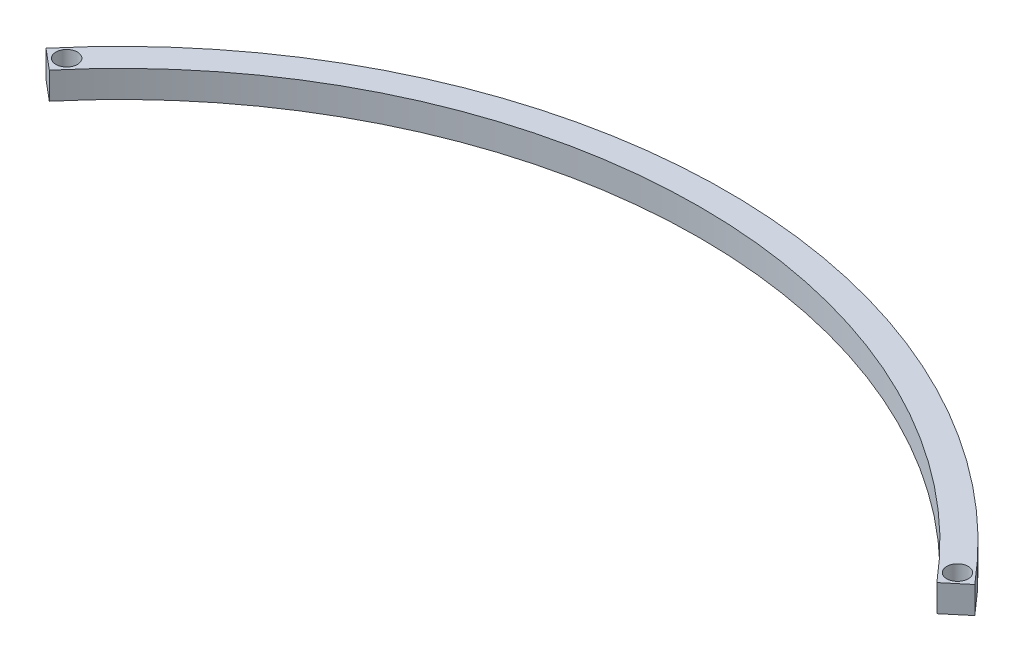
ISO-10303-21;
HEADER;
FILE_DESCRIPTION(('STEP AP214'),'2;1');
FILE_NAME('part.step','',(''),(''),'','','');
FILE_SCHEMA(('AUTOMOTIVE_DESIGN { 1 0 10303 214 1 1 1 1 }'));
ENDSEC;
DATA;
#1=APPLICATION_CONTEXT('core data for automotive mechanical design processes');
#2=APPLICATION_PROTOCOL_DEFINITION('international standard','automotive_design',2000,#1);
#3=PRODUCT_CONTEXT('',#1,'mechanical');
#4=PRODUCT('Part','Part','',(#3));
#5=PRODUCT_RELATED_PRODUCT_CATEGORY('part','',(#4));
#6=PRODUCT_DEFINITION_FORMATION('','',#4);
#7=PRODUCT_DEFINITION_CONTEXT('part definition',#1,'design');
#8=PRODUCT_DEFINITION('design','',#6,#7);
#9=PRODUCT_DEFINITION_SHAPE('','',#8);
#10=(LENGTH_UNIT() NAMED_UNIT(*) SI_UNIT(.MILLI.,.METRE.));
#11=(NAMED_UNIT(*) PLANE_ANGLE_UNIT() SI_UNIT($,.RADIAN.));
#12=(NAMED_UNIT(*) SI_UNIT($,.STERADIAN.) SOLID_ANGLE_UNIT());
#13=UNCERTAINTY_MEASURE_WITH_UNIT(LENGTH_MEASURE(1.E-05),#10,'distance_accuracy_value','');
#14=(GEOMETRIC_REPRESENTATION_CONTEXT(3) GLOBAL_UNCERTAINTY_ASSIGNED_CONTEXT((#13)) GLOBAL_UNIT_ASSIGNED_CONTEXT((#10,
#11,#12)) REPRESENTATION_CONTEXT('',''));
#15=CARTESIAN_POINT('',(0.,0.,0.));
#16=DIRECTION('',(0.,0.,1.));
#17=DIRECTION('',(1.,0.,0.));
#18=AXIS2_PLACEMENT_3D('',#15,#16,#17);
#19=CARTESIAN_POINT('',(0.,5.,0.));
#20=DIRECTION('',(0.,-1.,0.));
#21=DIRECTION('',(0.,0.,-1.));
#22=AXIS2_PLACEMENT_3D('',#19,#20,#21);
#23=PLANE('',#22);
#24=CARTESIAN_POINT('',(0.,5.,0.));
#25=DIRECTION('',(0.,1.,0.));
#26=DIRECTION('',(0.,0.,-1.));
#27=AXIS2_PLACEMENT_3D('',#24,#25,#26);
#28=CIRCLE('',#27,225.);
#29=CARTESIAN_POINT('',(172.35999970177,5.,-144.627212179472));
#30=VERTEX_POINT('',#29);
#31=CARTESIAN_POINT('',(-172.35999970177,5.,-144.627212179472));
#32=VERTEX_POINT('',#31);
#33=EDGE_CURVE('E95',#30,#32,#28,.T.);
#34=ORIENTED_EDGE('',*,*,#33,.T.);
#35=DIRECTION('',(0.766044443118975,0.,0.642787609686543));
#36=VECTOR('',#35,1.);
#37=CARTESIAN_POINT('',(-172.35999970177,5.,-144.627212179472));
#38=LINE('',#37,#36);
#39=CARTESIAN_POINT('',(-164.69955527058,5.,-138.199336082606));
#40=VERTEX_POINT('',#39);
#41=EDGE_CURVE('E90',#32,#40,#38,.T.);
#42=ORIENTED_EDGE('',*,*,#41,.T.);
#43=CARTESIAN_POINT('',(0.,5.,0.));
#44=DIRECTION('',(0.,-1.,0.));
#45=DIRECTION('',(0.,0.,-1.));
#46=AXIS2_PLACEMENT_3D('',#43,#44,#45);
#47=CIRCLE('',#46,215.);
#48=CARTESIAN_POINT('',(164.69955527058,5.,-138.199336082606));
#49=VERTEX_POINT('',#48);
#50=EDGE_CURVE('E93',#40,#49,#47,.T.);
#51=ORIENTED_EDGE('',*,*,#50,.T.);
#52=DIRECTION('',(0.766044443118975,0.,-0.642787609686543));
#53=VECTOR('',#52,1.);
#54=CARTESIAN_POINT('',(172.35999970177,5.,-144.627212179472));
#55=LINE('',#54,#53);
#56=EDGE_CURVE('E60',#49,#30,#55,.T.);
#57=ORIENTED_EDGE('',*,*,#56,.T.);
#58=EDGE_LOOP('',(#34,#42,#51,#57));
#59=FACE_BOUND('',#58,.T.);
#60=CARTESIAN_POINT('',(-165.315839437742,5.,-145.243496346634));
#61=DIRECTION('',(0.,1.,0.));
#62=DIRECTION('',(0.,0.,1.));
#63=AXIS2_PLACEMENT_3D('',#60,#61,#62);
#64=CIRCLE('',#63,3.99999999999999);
#65=CARTESIAN_POINT('',(-165.315839437742,5.,-141.243496346634));
#66=VERTEX_POINT('',#65);
#67=EDGE_CURVE('E110',#66,#66,#64,.T.);
#68=ORIENTED_EDGE('',*,*,#67,.F.);
#69=EDGE_LOOP('',(#68));
#70=FACE_BOUND('',#69,.T.);
#71=CARTESIAN_POINT('',(165.315839437742,5.,-145.243496346634));
#72=DIRECTION('',(0.,1.,0.));
#73=DIRECTION('',(0.,0.,-1.));
#74=AXIS2_PLACEMENT_3D('',#71,#72,#73);
#75=CIRCLE('',#74,3.99999999999999);
#76=CARTESIAN_POINT('',(165.315839437742,5.,-149.243496346634));
#77=VERTEX_POINT('',#76);
#78=EDGE_CURVE('E125',#77,#77,#75,.T.);
#79=ORIENTED_EDGE('',*,*,#78,.F.);
#80=EDGE_LOOP('',(#79));
#81=FACE_BOUND('',#80,.T.);
#82=ADVANCED_FACE('F43',(#59,#70,#81),#23,.F.);
#83=CARTESIAN_POINT('',(0.,-5.,0.));
#84=DIRECTION('',(0.,-1.,0.));
#85=DIRECTION('',(0.,0.,-1.));
#86=AXIS2_PLACEMENT_3D('',#83,#84,#85);
#87=PLANE('',#86);
#88=CARTESIAN_POINT('',(-165.315839437742,-5.,-145.243496346634));
#89=DIRECTION('',(0.,1.,0.));
#90=DIRECTION('',(0.,0.,1.));
#91=AXIS2_PLACEMENT_3D('',#88,#89,#90);
#92=CIRCLE('',#91,3.99999999999999);
#93=CARTESIAN_POINT('',(-165.315839437742,-5.,-141.243496346634));
#94=VERTEX_POINT('',#93);
#95=EDGE_CURVE('E122',#94,#94,#92,.T.);
#96=ORIENTED_EDGE('',*,*,#95,.T.);
#97=EDGE_LOOP('',(#96));
#98=FACE_BOUND('',#97,.T.);
#99=CARTESIAN_POINT('',(0.,-5.,0.));
#100=DIRECTION('',(0.,1.,0.));
#101=DIRECTION('',(0.,0.,-1.));
#102=AXIS2_PLACEMENT_3D('',#99,#100,#101);
#103=CIRCLE('',#102,225.);
#104=CARTESIAN_POINT('',(172.35999970177,-5.,-144.627212179472));
#105=VERTEX_POINT('',#104);
#106=CARTESIAN_POINT('',(-172.35999970177,-5.,-144.627212179472));
#107=VERTEX_POINT('',#106);
#108=EDGE_CURVE('E107',#105,#107,#103,.T.);
#109=ORIENTED_EDGE('',*,*,#108,.F.);
#110=DIRECTION('',(0.766044443118975,0.,-0.642787609686543));
#111=VECTOR('',#110,1.);
#112=CARTESIAN_POINT('',(172.35999970177,-5.,-144.627212179472));
#113=LINE('',#112,#111);
#114=CARTESIAN_POINT('',(164.69955527058,-5.,-138.199336082606));
#115=VERTEX_POINT('',#114);
#116=EDGE_CURVE('E83',#115,#105,#113,.T.);
#117=ORIENTED_EDGE('',*,*,#116,.F.);
#118=CARTESIAN_POINT('',(0.,-5.,0.));
#119=DIRECTION('',(0.,-1.,0.));
#120=DIRECTION('',(0.,0.,-1.));
#121=AXIS2_PLACEMENT_3D('',#118,#119,#120);
#122=CIRCLE('',#121,215.);
#123=CARTESIAN_POINT('',(-164.69955527058,-5.,-138.199336082606));
#124=VERTEX_POINT('',#123);
#125=EDGE_CURVE('E77',#124,#115,#122,.T.);
#126=ORIENTED_EDGE('',*,*,#125,.F.);
#127=DIRECTION('',(0.766044443118975,0.,0.642787609686543));
#128=VECTOR('',#127,1.);
#129=CARTESIAN_POINT('',(-172.35999970177,-5.,-144.627212179472));
#130=LINE('',#129,#128);
#131=EDGE_CURVE('E99',#107,#124,#130,.T.);
#132=ORIENTED_EDGE('',*,*,#131,.F.);
#133=EDGE_LOOP('',(#109,#117,#126,#132));
#134=FACE_BOUND('',#133,.T.);
#135=CARTESIAN_POINT('',(165.315839437742,-5.,-145.243496346634));
#136=DIRECTION('',(0.,1.,0.));
#137=DIRECTION('',(0.,0.,-1.));
#138=AXIS2_PLACEMENT_3D('',#135,#136,#137);
#139=CIRCLE('',#138,3.99999999999999);
#140=CARTESIAN_POINT('',(165.315839437742,-5.,-149.243496346634));
#141=VERTEX_POINT('',#140);
#142=EDGE_CURVE('E128',#141,#141,#139,.T.);
#143=ORIENTED_EDGE('',*,*,#142,.T.);
#144=EDGE_LOOP('',(#143));
#145=FACE_BOUND('',#144,.T.);
#146=ADVANCED_FACE('F118',(#98,#134,#145),#87,.T.);
#147=CARTESIAN_POINT('',(0.,5.,0.));
#148=DIRECTION('',(0.,-1.,0.));
#149=DIRECTION('',(0.,0.,-1.));
#150=AXIS2_PLACEMENT_3D('',#147,#148,#149);
#151=CYLINDRICAL_SURFACE('',#150,225.);
#152=ORIENTED_EDGE('',*,*,#108,.T.);
#153=DIRECTION('',(0.,-1.,0.));
#154=VECTOR('',#153,1.);
#155=CARTESIAN_POINT('',(-172.35999970177,5.,-144.627212179472));
#156=LINE('',#155,#154);
#157=EDGE_CURVE('E11',#32,#107,#156,.T.);
#158=ORIENTED_EDGE('',*,*,#157,.F.);
#159=ORIENTED_EDGE('',*,*,#33,.F.);
#160=DIRECTION('',(0.,-1.,0.));
#161=VECTOR('',#160,1.);
#162=CARTESIAN_POINT('',(172.35999970177,5.,-144.627212179472));
#163=LINE('',#162,#161);
#164=EDGE_CURVE('E103',#30,#105,#163,.T.);
#165=ORIENTED_EDGE('',*,*,#164,.T.);
#166=EDGE_LOOP('',(#152,#158,#159,#165));
#167=FACE_BOUND('',#166,.T.);
#168=ADVANCED_FACE('F45',(#167),#151,.T.);
#169=CARTESIAN_POINT('',(-172.35999970177,5.,-144.627212179472));
#170=DIRECTION('',(0.642787609686542,0.,-0.766044443118975));
#171=DIRECTION('',(-0.766044443118976,0.,-0.642787609686543));
#172=AXIS2_PLACEMENT_3D('',#169,#170,#171);
#173=PLANE('',#172);
#174=ORIENTED_EDGE('',*,*,#131,.T.);
#175=DIRECTION('',(0.,-1.,0.));
#176=VECTOR('',#175,1.);
#177=CARTESIAN_POINT('',(-164.69955527058,5.,-138.199336082606));
#178=LINE('',#177,#176);
#179=EDGE_CURVE('E52',#40,#124,#178,.T.);
#180=ORIENTED_EDGE('',*,*,#179,.F.);
#181=ORIENTED_EDGE('',*,*,#41,.F.);
#182=ORIENTED_EDGE('',*,*,#157,.T.);
#183=EDGE_LOOP('',(#174,#180,#181,#182));
#184=FACE_BOUND('',#183,.T.);
#185=ADVANCED_FACE('F98',(#184),#173,.F.);
#186=CARTESIAN_POINT('',(0.,5.,0.));
#187=DIRECTION('',(0.,-1.,0.));
#188=DIRECTION('',(0.,0.,-1.));
#189=AXIS2_PLACEMENT_3D('',#186,#187,#188);
#190=CYLINDRICAL_SURFACE('',#189,215.);
#191=ORIENTED_EDGE('',*,*,#125,.T.);
#192=DIRECTION('',(0.,-1.,0.));
#193=VECTOR('',#192,1.);
#194=CARTESIAN_POINT('',(164.69955527058,5.,-138.199336082606));
#195=LINE('',#194,#193);
#196=EDGE_CURVE('E100',#49,#115,#195,.T.);
#197=ORIENTED_EDGE('',*,*,#196,.F.);
#198=ORIENTED_EDGE('',*,*,#50,.F.);
#199=ORIENTED_EDGE('',*,*,#179,.T.);
#200=EDGE_LOOP('',(#191,#197,#198,#199));
#201=FACE_BOUND('',#200,.T.);
#202=ADVANCED_FACE('F101',(#201),#190,.F.);
#203=CARTESIAN_POINT('',(172.35999970177,5.,-144.627212179472));
#204=DIRECTION('',(-0.642787609686542,0.,-0.766044443118975));
#205=DIRECTION('',(-0.766044443118976,0.,0.642787609686543));
#206=AXIS2_PLACEMENT_3D('',#203,#204,#205);
#207=PLANE('',#206);
#208=ORIENTED_EDGE('',*,*,#116,.T.);
#209=ORIENTED_EDGE('',*,*,#164,.F.);
#210=ORIENTED_EDGE('',*,*,#56,.F.);
#211=ORIENTED_EDGE('',*,*,#196,.T.);
#212=EDGE_LOOP('',(#208,#209,#210,#211));
#213=FACE_BOUND('',#212,.T.);
#214=ADVANCED_FACE('F115',(#213),#207,.F.);
#215=CARTESIAN_POINT('',(-165.315839437742,5.,-145.243496346634));
#216=DIRECTION('',(0.,-1.,0.));
#217=DIRECTION('',(0.,0.,-1.));
#218=AXIS2_PLACEMENT_3D('',#215,#216,#217);
#219=CYLINDRICAL_SURFACE('',#218,3.99999999999999);
#220=ORIENTED_EDGE('',*,*,#67,.T.);
#221=EDGE_LOOP('',(#220));
#222=FACE_BOUND('',#221,.T.);
#223=ORIENTED_EDGE('',*,*,#95,.F.);
#224=EDGE_LOOP('',(#223));
#225=FACE_BOUND('',#224,.T.);
#226=ADVANCED_FACE('F145',(#222,#225),#219,.F.);
#227=CARTESIAN_POINT('',(165.315839437742,5.,-145.243496346634));
#228=DIRECTION('',(0.,-1.,0.));
#229=DIRECTION('',(0.,0.,-1.));
#230=AXIS2_PLACEMENT_3D('',#227,#228,#229);
#231=CYLINDRICAL_SURFACE('',#230,3.99999999999999);
#232=ORIENTED_EDGE('',*,*,#78,.T.);
#233=EDGE_LOOP('',(#232));
#234=FACE_BOUND('',#233,.T.);
#235=ORIENTED_EDGE('',*,*,#142,.F.);
#236=EDGE_LOOP('',(#235));
#237=FACE_BOUND('',#236,.T.);
#238=ADVANCED_FACE('F134',(#234,#237),#231,.F.);
#239=CLOSED_SHELL('',(#82,#146,#168,#185,#202,#214,#226,#238));
#240=MANIFOLD_SOLID_BREP('B2',#239);
#241=ADVANCED_BREP_SHAPE_REPRESENTATION('',(#18,#240),#14);
#242=SHAPE_DEFINITION_REPRESENTATION(#9,#241);
ENDSEC;
END-ISO-10303-21;
